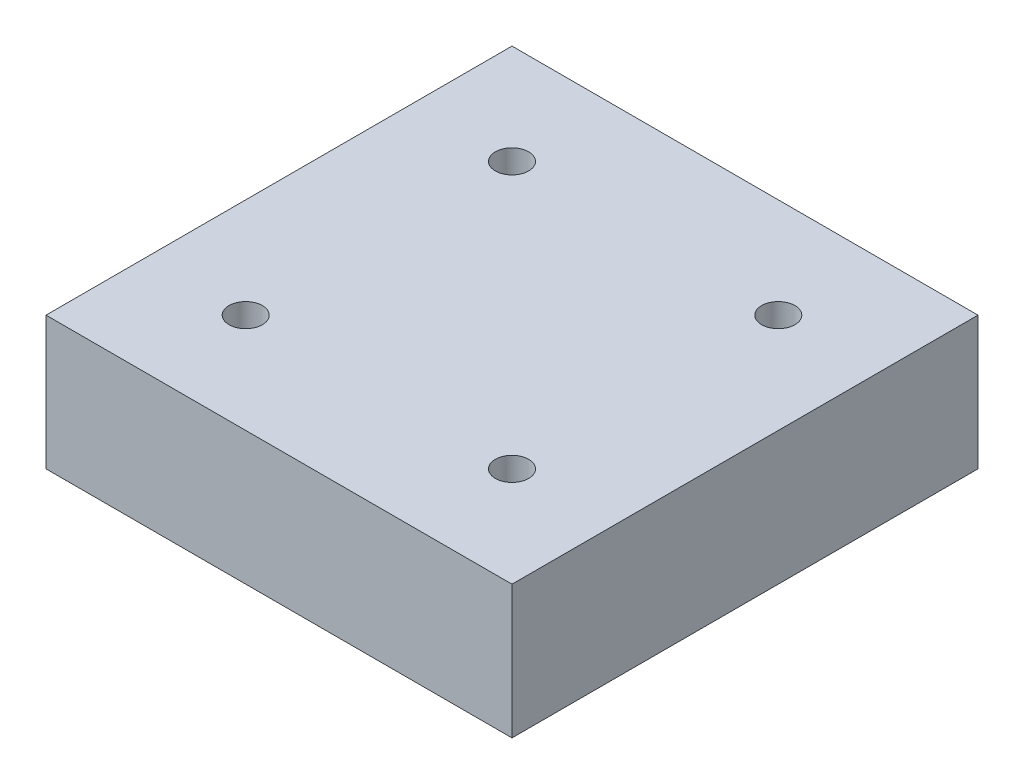
ISO-10303-21;
HEADER;
FILE_DESCRIPTION(('STEP AP214'),'2;1');
FILE_NAME('part.step','',(''),(''),'','','');
FILE_SCHEMA(('AUTOMOTIVE_DESIGN { 1 0 10303 214 1 1 1 1 }'));
ENDSEC;
DATA;
#1=APPLICATION_CONTEXT('core data for automotive mechanical design processes');
#2=APPLICATION_PROTOCOL_DEFINITION('international standard','automotive_design',2000,#1);
#3=PRODUCT_CONTEXT('',#1,'mechanical');
#4=PRODUCT('Part','Part','',(#3));
#5=PRODUCT_RELATED_PRODUCT_CATEGORY('part','',(#4));
#6=PRODUCT_DEFINITION_FORMATION('','',#4);
#7=PRODUCT_DEFINITION_CONTEXT('part definition',#1,'design');
#8=PRODUCT_DEFINITION('design','',#6,#7);
#9=PRODUCT_DEFINITION_SHAPE('','',#8);
#10=(LENGTH_UNIT() NAMED_UNIT(*) SI_UNIT(.MILLI.,.METRE.));
#11=(NAMED_UNIT(*) PLANE_ANGLE_UNIT() SI_UNIT($,.RADIAN.));
#12=(NAMED_UNIT(*) SI_UNIT($,.STERADIAN.) SOLID_ANGLE_UNIT());
#13=UNCERTAINTY_MEASURE_WITH_UNIT(LENGTH_MEASURE(1.E-05),#10,'distance_accuracy_value','');
#14=(GEOMETRIC_REPRESENTATION_CONTEXT(3) GLOBAL_UNCERTAINTY_ASSIGNED_CONTEXT((#13)) GLOBAL_UNIT_ASSIGNED_CONTEXT((#10,
#11,#12)) REPRESENTATION_CONTEXT('',''));
#15=CARTESIAN_POINT('',(0.,0.,0.));
#16=DIRECTION('',(0.,0.,1.));
#17=DIRECTION('',(1.,0.,0.));
#18=AXIS2_PLACEMENT_3D('',#15,#16,#17);
#19=CARTESIAN_POINT('',(35.,20.,35.));
#20=DIRECTION('',(-1.,0.,0.));
#21=DIRECTION('',(0.,0.,1.));
#22=AXIS2_PLACEMENT_3D('',#19,#20,#21);
#23=PLANE('',#22);
#24=DIRECTION('',(0.,0.,-1.));
#25=VECTOR('',#24,1.);
#26=CARTESIAN_POINT('',(35.,0.,35.));
#27=LINE('',#26,#25);
#28=CARTESIAN_POINT('',(35.,0.,35.));
#29=VERTEX_POINT('',#28);
#30=CARTESIAN_POINT('',(35.,0.,-35.));
#31=VERTEX_POINT('',#30);
#32=EDGE_CURVE('E134',#29,#31,#27,.T.);
#33=ORIENTED_EDGE('',*,*,#32,.T.);
#34=DIRECTION('',(0.,-1.,0.));
#35=VECTOR('',#34,1.);
#36=CARTESIAN_POINT('',(35.,20.,-35.));
#37=LINE('',#36,#35);
#38=CARTESIAN_POINT('',(35.,20.,-35.));
#39=VERTEX_POINT('',#38);
#40=EDGE_CURVE('E11',#39,#31,#37,.T.);
#41=ORIENTED_EDGE('',*,*,#40,.F.);
#42=DIRECTION('',(0.,0.,-1.));
#43=VECTOR('',#42,1.);
#44=CARTESIAN_POINT('',(35.,20.,35.));
#45=LINE('',#44,#43);
#46=CARTESIAN_POINT('',(35.,20.,35.));
#47=VERTEX_POINT('',#46);
#48=EDGE_CURVE('E135',#47,#39,#45,.T.);
#49=ORIENTED_EDGE('',*,*,#48,.F.);
#50=DIRECTION('',(0.,-1.,0.));
#51=VECTOR('',#50,1.);
#52=CARTESIAN_POINT('',(35.,20.,35.));
#53=LINE('',#52,#51);
#54=EDGE_CURVE('E141',#47,#29,#53,.T.);
#55=ORIENTED_EDGE('',*,*,#54,.T.);
#56=EDGE_LOOP('',(#33,#41,#49,#55));
#57=FACE_BOUND('',#56,.T.);
#58=ADVANCED_FACE('F41',(#57),#23,.F.);
#59=CARTESIAN_POINT('',(-35.,20.,-35.));
#60=DIRECTION('',(0.,0.,1.));
#61=DIRECTION('',(1.,0.,0.));
#62=AXIS2_PLACEMENT_3D('',#59,#60,#61);
#63=PLANE('',#62);
#64=DIRECTION('',(-1.,0.,0.));
#65=VECTOR('',#64,1.);
#66=CARTESIAN_POINT('',(-35.,0.,-35.));
#67=LINE('',#66,#65);
#68=CARTESIAN_POINT('',(-35.,0.,-35.));
#69=VERTEX_POINT('',#68);
#70=EDGE_CURVE('E144',#31,#69,#67,.T.);
#71=ORIENTED_EDGE('',*,*,#70,.T.);
#72=DIRECTION('',(0.,-1.,0.));
#73=VECTOR('',#72,1.);
#74=CARTESIAN_POINT('',(-35.,20.,-35.));
#75=LINE('',#74,#73);
#76=CARTESIAN_POINT('',(-35.,20.,-35.));
#77=VERTEX_POINT('',#76);
#78=EDGE_CURVE('E49',#77,#69,#75,.T.);
#79=ORIENTED_EDGE('',*,*,#78,.F.);
#80=DIRECTION('',(-1.,0.,0.));
#81=VECTOR('',#80,1.);
#82=CARTESIAN_POINT('',(-35.,20.,-35.));
#83=LINE('',#82,#81);
#84=EDGE_CURVE('E88',#39,#77,#83,.T.);
#85=ORIENTED_EDGE('',*,*,#84,.F.);
#86=ORIENTED_EDGE('',*,*,#40,.T.);
#87=EDGE_LOOP('',(#71,#79,#85,#86));
#88=FACE_BOUND('',#87,.T.);
#89=ADVANCED_FACE('F168',(#88),#63,.F.);
#90=CARTESIAN_POINT('',(-35.,20.,35.));
#91=DIRECTION('',(1.,0.,0.));
#92=DIRECTION('',(0.,0.,-1.));
#93=AXIS2_PLACEMENT_3D('',#90,#91,#92);
#94=PLANE('',#93);
#95=DIRECTION('',(0.,0.,1.));
#96=VECTOR('',#95,1.);
#97=CARTESIAN_POINT('',(-35.,0.,35.));
#98=LINE('',#97,#96);
#99=CARTESIAN_POINT('',(-35.,0.,35.));
#100=VERTEX_POINT('',#99);
#101=EDGE_CURVE('E75',#69,#100,#98,.T.);
#102=ORIENTED_EDGE('',*,*,#101,.T.);
#103=DIRECTION('',(0.,-1.,0.));
#104=VECTOR('',#103,1.);
#105=CARTESIAN_POINT('',(-35.,20.,35.));
#106=LINE('',#105,#104);
#107=CARTESIAN_POINT('',(-35.,20.,35.));
#108=VERTEX_POINT('',#107);
#109=EDGE_CURVE('E149',#108,#100,#106,.T.);
#110=ORIENTED_EDGE('',*,*,#109,.F.);
#111=DIRECTION('',(0.,0.,1.));
#112=VECTOR('',#111,1.);
#113=CARTESIAN_POINT('',(-35.,20.,35.));
#114=LINE('',#113,#112);
#115=EDGE_CURVE('E138',#77,#108,#114,.T.);
#116=ORIENTED_EDGE('',*,*,#115,.F.);
#117=ORIENTED_EDGE('',*,*,#78,.T.);
#118=EDGE_LOOP('',(#102,#110,#116,#117));
#119=FACE_BOUND('',#118,.T.);
#120=ADVANCED_FACE('F151',(#119),#94,.F.);
#121=CARTESIAN_POINT('',(-35.,20.,35.));
#122=DIRECTION('',(0.,0.,-1.));
#123=DIRECTION('',(-1.,0.,0.));
#124=AXIS2_PLACEMENT_3D('',#121,#122,#123);
#125=PLANE('',#124);
#126=DIRECTION('',(1.,0.,0.));
#127=VECTOR('',#126,1.);
#128=CARTESIAN_POINT('',(-35.,0.,35.));
#129=LINE('',#128,#127);
#130=EDGE_CURVE('E81',#100,#29,#129,.T.);
#131=ORIENTED_EDGE('',*,*,#130,.T.);
#132=ORIENTED_EDGE('',*,*,#54,.F.);
#133=DIRECTION('',(1.,0.,0.));
#134=VECTOR('',#133,1.);
#135=CARTESIAN_POINT('',(-35.,20.,35.));
#136=LINE('',#135,#134);
#137=EDGE_CURVE('E57',#108,#47,#136,.T.);
#138=ORIENTED_EDGE('',*,*,#137,.F.);
#139=ORIENTED_EDGE('',*,*,#109,.T.);
#140=EDGE_LOOP('',(#131,#132,#138,#139));
#141=FACE_BOUND('',#140,.T.);
#142=ADVANCED_FACE('F158',(#141),#125,.F.);
#143=CARTESIAN_POINT('',(0.,20.,0.));
#144=DIRECTION('',(0.,-1.,0.));
#145=DIRECTION('',(0.,0.,-1.));
#146=AXIS2_PLACEMENT_3D('',#143,#144,#145);
#147=PLANE('',#146);
#148=CARTESIAN_POINT('',(20.,20.,-20.));
#149=DIRECTION('',(0.,1.,0.));
#150=DIRECTION('',(0.,0.,1.));
#151=AXIS2_PLACEMENT_3D('',#148,#149,#150);
#152=CIRCLE('',#151,2.49999999999999);
#153=CARTESIAN_POINT('',(20.,20.,-17.5));
#154=VERTEX_POINT('',#153);
#155=EDGE_CURVE('E112',#154,#154,#152,.T.);
#156=ORIENTED_EDGE('',*,*,#155,.F.);
#157=EDGE_LOOP('',(#156));
#158=FACE_BOUND('',#157,.T.);
#159=CARTESIAN_POINT('',(20.,20.,20.));
#160=DIRECTION('',(0.,1.,0.));
#161=DIRECTION('',(0.,0.,1.));
#162=AXIS2_PLACEMENT_3D('',#159,#160,#161);
#163=CIRCLE('',#162,2.49999999999999);
#164=CARTESIAN_POINT('',(20.,20.,22.5));
#165=VERTEX_POINT('',#164);
#166=EDGE_CURVE('E111',#165,#165,#163,.T.);
#167=ORIENTED_EDGE('',*,*,#166,.F.);
#168=EDGE_LOOP('',(#167));
#169=FACE_BOUND('',#168,.T.);
#170=CARTESIAN_POINT('',(-20.,20.,20.));
#171=DIRECTION('',(0.,1.,0.));
#172=DIRECTION('',(0.,0.,1.));
#173=AXIS2_PLACEMENT_3D('',#170,#171,#172);
#174=CIRCLE('',#173,2.49999999999999);
#175=CARTESIAN_POINT('',(-20.,20.,22.5));
#176=VERTEX_POINT('',#175);
#177=EDGE_CURVE('E122',#176,#176,#174,.T.);
#178=ORIENTED_EDGE('',*,*,#177,.F.);
#179=EDGE_LOOP('',(#178));
#180=FACE_BOUND('',#179,.T.);
#181=CARTESIAN_POINT('',(-20.,20.,-20.));
#182=DIRECTION('',(0.,1.,0.));
#183=DIRECTION('',(0.,0.,1.));
#184=AXIS2_PLACEMENT_3D('',#181,#182,#183);
#185=CIRCLE('',#184,2.49999999999999);
#186=CARTESIAN_POINT('',(-20.,20.,-17.5));
#187=VERTEX_POINT('',#186);
#188=EDGE_CURVE('E128',#187,#187,#185,.T.);
#189=ORIENTED_EDGE('',*,*,#188,.F.);
#190=EDGE_LOOP('',(#189));
#191=FACE_BOUND('',#190,.T.);
#192=ORIENTED_EDGE('',*,*,#48,.T.);
#193=ORIENTED_EDGE('',*,*,#84,.T.);
#194=ORIENTED_EDGE('',*,*,#115,.T.);
#195=ORIENTED_EDGE('',*,*,#137,.T.);
#196=EDGE_LOOP('',(#192,#193,#194,#195));
#197=FACE_BOUND('',#196,.T.);
#198=ADVANCED_FACE('F160',(#158,#169,#180,#191,#197),#147,.F.);
#199=CARTESIAN_POINT('',(0.,0.,0.));
#200=DIRECTION('',(0.,-1.,0.));
#201=DIRECTION('',(0.,0.,-1.));
#202=AXIS2_PLACEMENT_3D('',#199,#200,#201);
#203=PLANE('',#202);
#204=ORIENTED_EDGE('',*,*,#32,.F.);
#205=ORIENTED_EDGE('',*,*,#130,.F.);
#206=ORIENTED_EDGE('',*,*,#101,.F.);
#207=ORIENTED_EDGE('',*,*,#70,.F.);
#208=EDGE_LOOP('',(#204,#205,#206,#207));
#209=FACE_BOUND('',#208,.T.);
#210=ADVANCED_FACE('F154',(#209),#203,.T.);
#211=CARTESIAN_POINT('',(-20.,5.,-20.));
#212=DIRECTION('',(0.,1.,0.));
#213=DIRECTION('',(0.,0.,1.));
#214=AXIS2_PLACEMENT_3D('',#211,#212,#213);
#215=CONICAL_SURFACE('',#214,2.49999999999999,1.02974425867665);
#216=CARTESIAN_POINT('',(-20.,3.4978484524311,-20.));
#217=VERTEX_POINT('',#216);
#218=VERTEX_LOOP('',#217);
#219=FACE_BOUND('',#218,.T.);
#220=CARTESIAN_POINT('',(-20.,5.,-20.));
#221=DIRECTION('',(0.,1.,0.));
#222=DIRECTION('',(0.,0.,1.));
#223=AXIS2_PLACEMENT_3D('',#220,#221,#222);
#224=CIRCLE('',#223,2.49999999999999);
#225=CARTESIAN_POINT('',(-20.,5.,-17.5));
#226=VERTEX_POINT('',#225);
#227=EDGE_CURVE('E131',#226,#226,#224,.T.);
#228=ORIENTED_EDGE('',*,*,#227,.T.);
#229=EDGE_LOOP('',(#228));
#230=FACE_BOUND('',#229,.T.);
#231=ADVANCED_FACE('F195',(#219,#230),#215,.F.);
#232=CARTESIAN_POINT('',(-20.,20.,-20.));
#233=DIRECTION('',(0.,1.,0.));
#234=DIRECTION('',(0.,0.,1.));
#235=AXIS2_PLACEMENT_3D('',#232,#233,#234);
#236=CYLINDRICAL_SURFACE('',#235,2.49999999999999);
#237=ORIENTED_EDGE('',*,*,#227,.F.);
#238=EDGE_LOOP('',(#237));
#239=FACE_BOUND('',#238,.T.);
#240=ORIENTED_EDGE('',*,*,#188,.T.);
#241=EDGE_LOOP('',(#240));
#242=FACE_BOUND('',#241,.T.);
#243=ADVANCED_FACE('F211',(#239,#242),#236,.F.);
#244=CARTESIAN_POINT('',(-20.,5.,20.));
#245=DIRECTION('',(0.,1.,0.));
#246=DIRECTION('',(0.,0.,1.));
#247=AXIS2_PLACEMENT_3D('',#244,#245,#246);
#248=CONICAL_SURFACE('',#247,2.49999999999999,1.02974425867665);
#249=CARTESIAN_POINT('',(-20.,3.4978484524311,20.));
#250=VERTEX_POINT('',#249);
#251=VERTEX_LOOP('',#250);
#252=FACE_BOUND('',#251,.T.);
#253=CARTESIAN_POINT('',(-20.,5.,20.));
#254=DIRECTION('',(0.,1.,0.));
#255=DIRECTION('',(0.,0.,1.));
#256=AXIS2_PLACEMENT_3D('',#253,#254,#255);
#257=CIRCLE('',#256,2.49999999999999);
#258=CARTESIAN_POINT('',(-20.,5.,22.5));
#259=VERTEX_POINT('',#258);
#260=EDGE_CURVE('E125',#259,#259,#257,.T.);
#261=ORIENTED_EDGE('',*,*,#260,.T.);
#262=EDGE_LOOP('',(#261));
#263=FACE_BOUND('',#262,.T.);
#264=ADVANCED_FACE('F222',(#252,#263),#248,.F.);
#265=CARTESIAN_POINT('',(-20.,20.,20.));
#266=DIRECTION('',(0.,1.,0.));
#267=DIRECTION('',(0.,0.,1.));
#268=AXIS2_PLACEMENT_3D('',#265,#266,#267);
#269=CYLINDRICAL_SURFACE('',#268,2.49999999999999);
#270=ORIENTED_EDGE('',*,*,#260,.F.);
#271=EDGE_LOOP('',(#270));
#272=FACE_BOUND('',#271,.T.);
#273=ORIENTED_EDGE('',*,*,#177,.T.);
#274=EDGE_LOOP('',(#273));
#275=FACE_BOUND('',#274,.T.);
#276=ADVANCED_FACE('F234',(#272,#275),#269,.F.);
#277=CARTESIAN_POINT('',(20.,5.,20.));
#278=DIRECTION('',(0.,1.,0.));
#279=DIRECTION('',(0.,0.,1.));
#280=AXIS2_PLACEMENT_3D('',#277,#278,#279);
#281=CONICAL_SURFACE('',#280,2.49999999999999,1.02974425867665);
#282=CARTESIAN_POINT('',(20.,3.4978484524311,20.));
#283=VERTEX_POINT('',#282);
#284=VERTEX_LOOP('',#283);
#285=FACE_BOUND('',#284,.T.);
#286=CARTESIAN_POINT('',(20.,5.,20.));
#287=DIRECTION('',(0.,1.,0.));
#288=DIRECTION('',(0.,0.,1.));
#289=AXIS2_PLACEMENT_3D('',#286,#287,#288);
#290=CIRCLE('',#289,2.49999999999999);
#291=CARTESIAN_POINT('',(20.,5.,22.5));
#292=VERTEX_POINT('',#291);
#293=EDGE_CURVE('E115',#292,#292,#290,.T.);
#294=ORIENTED_EDGE('',*,*,#293,.T.);
#295=EDGE_LOOP('',(#294));
#296=FACE_BOUND('',#295,.T.);
#297=ADVANCED_FACE('F244',(#285,#296),#281,.F.);
#298=CARTESIAN_POINT('',(20.,20.,20.));
#299=DIRECTION('',(0.,1.,0.));
#300=DIRECTION('',(0.,0.,1.));
#301=AXIS2_PLACEMENT_3D('',#298,#299,#300);
#302=CYLINDRICAL_SURFACE('',#301,2.49999999999999);
#303=ORIENTED_EDGE('',*,*,#293,.F.);
#304=EDGE_LOOP('',(#303));
#305=FACE_BOUND('',#304,.T.);
#306=ORIENTED_EDGE('',*,*,#166,.T.);
#307=EDGE_LOOP('',(#306));
#308=FACE_BOUND('',#307,.T.);
#309=ADVANCED_FACE('F105',(#305,#308),#302,.F.);
#310=CARTESIAN_POINT('',(20.,5.,-20.));
#311=DIRECTION('',(0.,1.,0.));
#312=DIRECTION('',(0.,0.,1.));
#313=AXIS2_PLACEMENT_3D('',#310,#311,#312);
#314=CONICAL_SURFACE('',#313,2.49999999999999,1.02974425867665);
#315=CARTESIAN_POINT('',(20.,3.4978484524311,-20.));
#316=VERTEX_POINT('',#315);
#317=VERTEX_LOOP('',#316);
#318=FACE_BOUND('',#317,.T.);
#319=CARTESIAN_POINT('',(20.,5.,-20.));
#320=DIRECTION('',(0.,1.,0.));
#321=DIRECTION('',(0.,0.,1.));
#322=AXIS2_PLACEMENT_3D('',#319,#320,#321);
#323=CIRCLE('',#322,2.49999999999999);
#324=CARTESIAN_POINT('',(20.,5.,-17.5));
#325=VERTEX_POINT('',#324);
#326=EDGE_CURVE('E109',#325,#325,#323,.T.);
#327=ORIENTED_EDGE('',*,*,#326,.T.);
#328=EDGE_LOOP('',(#327));
#329=FACE_BOUND('',#328,.T.);
#330=ADVANCED_FACE('F101',(#318,#329),#314,.F.);
#331=CARTESIAN_POINT('',(20.,20.,-20.));
#332=DIRECTION('',(0.,1.,0.));
#333=DIRECTION('',(0.,0.,1.));
#334=AXIS2_PLACEMENT_3D('',#331,#332,#333);
#335=CYLINDRICAL_SURFACE('',#334,2.49999999999999);
#336=ORIENTED_EDGE('',*,*,#326,.F.);
#337=EDGE_LOOP('',(#336));
#338=FACE_BOUND('',#337,.T.);
#339=ORIENTED_EDGE('',*,*,#155,.T.);
#340=EDGE_LOOP('',(#339));
#341=FACE_BOUND('',#340,.T.);
#342=ADVANCED_FACE('F104',(#338,#341),#335,.F.);
#343=CLOSED_SHELL('',(#58,#89,#120,#142,#198,#210,#231,#243,#264,#276,#297,#309,#330,#342));
#344=MANIFOLD_SOLID_BREP('B2',#343);
#345=ADVANCED_BREP_SHAPE_REPRESENTATION('',(#18,#344),#14);
#346=SHAPE_DEFINITION_REPRESENTATION(#9,#345);
ENDSEC;
END-ISO-10303-21;
